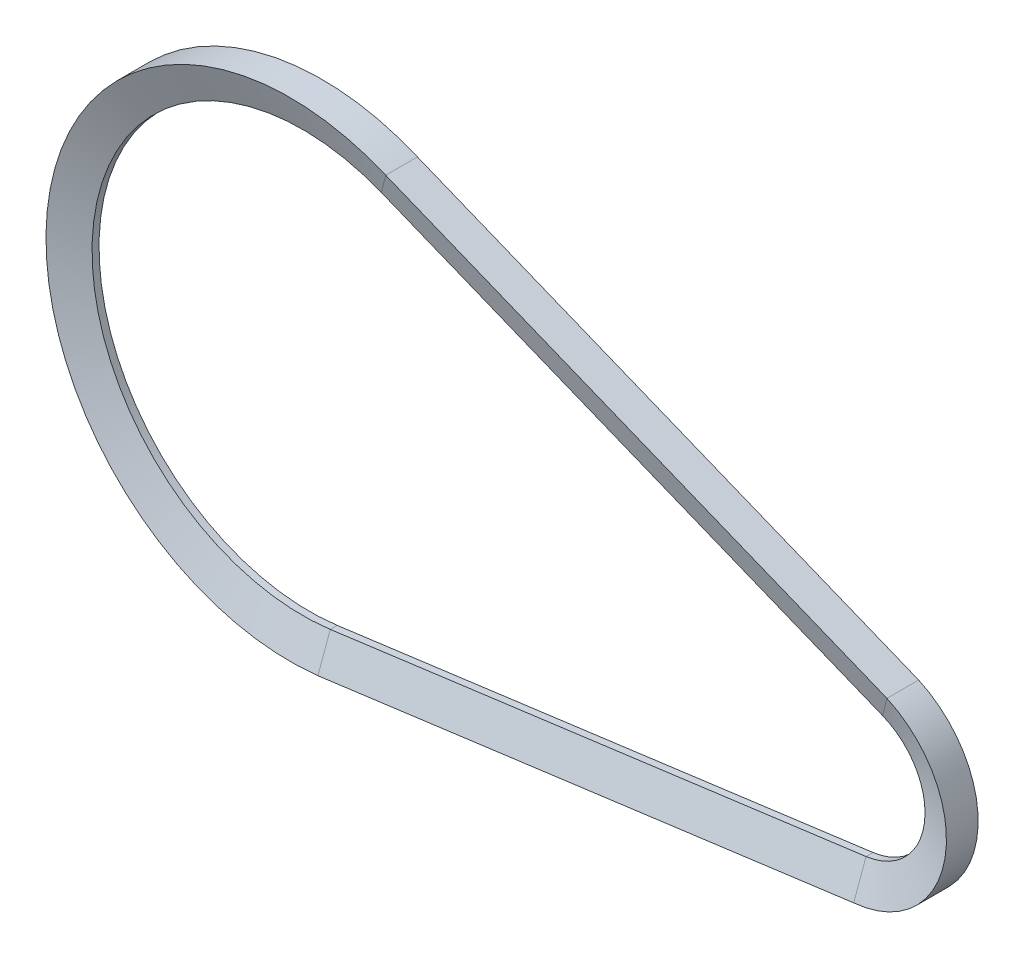
ISO-10303-21;
HEADER;
FILE_DESCRIPTION(('STEP AP214'),'2;1');
FILE_NAME('part.step','',(''),(''),'','','');
FILE_SCHEMA(('AUTOMOTIVE_DESIGN { 1 0 10303 214 1 1 1 1 }'));
ENDSEC;
DATA;
#1=APPLICATION_CONTEXT('core data for automotive mechanical design processes');
#2=APPLICATION_PROTOCOL_DEFINITION('international standard','automotive_design',2000,#1);
#3=PRODUCT_CONTEXT('',#1,'mechanical');
#4=PRODUCT('Part','Part','',(#3));
#5=PRODUCT_RELATED_PRODUCT_CATEGORY('part','',(#4));
#6=PRODUCT_DEFINITION_FORMATION('','',#4);
#7=PRODUCT_DEFINITION_CONTEXT('part definition',#1,'design');
#8=PRODUCT_DEFINITION('design','',#6,#7);
#9=PRODUCT_DEFINITION_SHAPE('','',#8);
#10=(LENGTH_UNIT() NAMED_UNIT(*) SI_UNIT(.MILLI.,.METRE.));
#11=(NAMED_UNIT(*) PLANE_ANGLE_UNIT() SI_UNIT($,.RADIAN.));
#12=(NAMED_UNIT(*) SI_UNIT($,.STERADIAN.) SOLID_ANGLE_UNIT());
#13=UNCERTAINTY_MEASURE_WITH_UNIT(LENGTH_MEASURE(1.E-05),#10,'distance_accuracy_value','');
#14=(GEOMETRIC_REPRESENTATION_CONTEXT(3) GLOBAL_UNCERTAINTY_ASSIGNED_CONTEXT((#13)) GLOBAL_UNIT_ASSIGNED_CONTEXT((#10,
#11,#12)) REPRESENTATION_CONTEXT('',''));
#15=CARTESIAN_POINT('',(0.,0.,0.));
#16=DIRECTION('',(0.,0.,1.));
#17=DIRECTION('',(1.,0.,0.));
#18=AXIS2_PLACEMENT_3D('',#15,#16,#17);
#19=CARTESIAN_POINT('',(124.475719306739,-30.3693151564213,0.770223243003508));
#20=DIRECTION('',(0.0453981297575215,-0.341667511459933,-0.93872377269743));
#21=DIRECTION('',(0.,0.93969262078591,-0.342020143325666));
#22=AXIS2_PLACEMENT_3D('',#19,#20,#21);
#23=PLANE('',#22);
#24=DIRECTION('',(0.,-0.939692620785909,0.342020143325666));
#25=VECTOR('',#24,1.);
#26=CARTESIAN_POINT('',(124.475719306739,-30.3693151564213,0.770223243003508));
#27=LINE('',#26,#25);
#28=CARTESIAN_POINT('',(124.475719306739,-30.3693151564213,0.770223243003508));
#29=VERTEX_POINT('',#28);
#30=CARTESIAN_POINT('',(124.475719306739,-37.8693151564213,3.5));
#31=VERTEX_POINT('',#30);
#32=EDGE_CURVE('E155',#29,#31,#27,.T.);
#33=ORIENTED_EDGE('',*,*,#32,.F.);
#34=DIRECTION('',(-0.991287677094754,-0.131714620449235,0.));
#35=VECTOR('',#34,1.);
#36=CARTESIAN_POINT('',(124.475719306739,-30.3693151564213,0.770223243003508));
#37=LINE('',#36,#35);
#38=CARTESIAN_POINT('',(6.12472985088943,-46.0948769849061,0.770223243003508));
#39=VERTEX_POINT('',#38);
#40=EDGE_CURVE('E154',#29,#39,#37,.T.);
#41=ORIENTED_EDGE('',*,*,#40,.T.);
#42=DIRECTION('',(0.,-0.939692620785909,0.342020143325666));
#43=VECTOR('',#42,1.);
#44=CARTESIAN_POINT('',(6.12472985088943,-46.0948769849061,0.770223243003508));
#45=LINE('',#44,#43);
#46=CARTESIAN_POINT('',(6.12472985088943,-53.5948769849061,3.5));
#47=VERTEX_POINT('',#46);
#48=EDGE_CURVE('E133',#39,#47,#45,.T.);
#49=ORIENTED_EDGE('',*,*,#48,.T.);
#50=DIRECTION('',(-0.991287677094754,-0.131714620449235,0.));
#51=VECTOR('',#50,1.);
#52=CARTESIAN_POINT('',(124.475719306739,-37.8693151564214,3.5));
#53=LINE('',#52,#51);
#54=EDGE_CURVE('E159',#31,#47,#53,.T.);
#55=ORIENTED_EDGE('',*,*,#54,.F.);
#56=EDGE_LOOP('',(#33,#41,#49,#55));
#57=FACE_BOUND('',#56,.T.);
#58=ADVANCED_FACE('F39',(#57),#23,.F.);
#59=CARTESIAN_POINT('',(6.12472985088943,-46.0948769849061,0.770223243003508));
#60=CARTESIAN_POINT('',(-26.763809279918,-50.4648510588701,0.770223243003508));
#61=CARTESIAN_POINT('',(-50.2969528979131,-27.0780207687135,0.770223243003508));
#62=CARTESIAN_POINT('',(-46.1321783681313,5.8371327731105,0.770223243003508));
#63=CARTESIAN_POINT('',(-41.9674038383495,38.7522863149345,0.770223243003508));
#64=CARTESIAN_POINT('',(-13.3508763277611,55.5405867888214,0.770223243003508));
#65=CARTESIAN_POINT('',(17.412721367423,43.1166688715686,0.770223243003508));
#66=CARTESIAN_POINT('',(6.12472985088943,-53.5948769849061,3.5));
#67=CARTESIAN_POINT('',(-32.1150339629088,-57.9648510588701,3.5));
#68=CARTESIAN_POINT('',(-58.9139401287493,-30.3388698408812,3.5));
#69=CARTESIAN_POINT('',(-53.3840209820254,7.75044892662746,3.5));
#70=CARTESIAN_POINT('',(-47.8541018353016,45.8397676941362,3.5));
#71=CARTESIAN_POINT('',(-14.3055621138431,64.7043295098772,3.5));
#72=CARTESIAN_POINT('',(21.1127393983367,49.6404612173529,3.5));
#73=(BOUNDED_SURFACE() B_SPLINE_SURFACE(1,3,((#59,#60,#61,#62,#63,#64,#65),(#66,#67,#68,#69,#70,
#71,#72)),.UNSPECIFIED.,.F.,.F.,.F.) B_SPLINE_SURFACE_WITH_KNOTS((2,2),(4,3,4),(0.,1.),(0.,0.5,
1.),.UNSPECIFIED.) GEOMETRIC_REPRESENTATION_ITEM() RATIONAL_B_SPLINE_SURFACE(((1.,
0.740188803038642,0.740188803038642,1.,0.740188803038642,0.740188803038642,1.),(1.,
0.740188803038642,0.740188803038642,1.,0.740188803038642,0.740188803038642,1.))) REPRESENTATION_ITEM('') SURFACE());
#74=CARTESIAN_POINT('',(0.,0.,3.5));
#75=DIRECTION('',(0.,0.,-1.));
#76=DIRECTION('',(0.113539290883504,-0.993533506946631,0.));
#77=AXIS2_PLACEMENT_3D('',#74,#75,#76);
#78=CIRCLE('',#77,53.94370356931);
#79=CARTESIAN_POINT('',(21.1127393983366,49.6404612173529,3.5));
#80=VERTEX_POINT('',#79);
#81=EDGE_CURVE('E123',#47,#80,#78,.T.);
#82=CARTESIAN_POINT('',(0.,0.,0.770223243003508));
#83=DIRECTION('',(0.,0.,-1.));
#84=DIRECTION('',(0.131714620449235,-0.991287677094754,0.));
#85=AXIS2_PLACEMENT_3D('',#82,#83,#84);
#86=CIRCLE('',#85,46.5);
#87=CARTESIAN_POINT('',(17.4127213674229,43.1166688715686,0.770223243003508));
#88=VERTEX_POINT('',#87);
#89=EDGE_CURVE('E136',#39,#88,#86,.T.);
#90=DIRECTION('',(0.463583952056587,0.817381270249745,0.342020143325666));
#91=VECTOR('',#90,1.);
#92=CARTESIAN_POINT('',(17.4127213674229,43.1166688715686,0.770223243003508));
#93=LINE('',#92,#91);
#94=EDGE_CURVE('E151',#88,#80,#93,.T.);
#95=ORIENTED_EDGE('',*,*,#81,.F.);
#96=ORIENTED_EDGE('',*,*,#48,.F.);
#97=ORIENTED_EDGE('',*,*,#89,.T.);
#98=ORIENTED_EDGE('',*,*,#94,.T.);
#99=EDGE_LOOP('',(#95,#96,#97,#98));
#100=FACE_BOUND('',#99,.T.);
#101=ADVANCED_FACE('F135',(#100),#73,.F.);
#102=CARTESIAN_POINT('',(0.,0.,0.));
#103=DIRECTION('',(0.,0.,-1.));
#104=DIRECTION('',(-1.,0.,0.));
#105=AXIS2_PLACEMENT_3D('',#102,#103,#104);
#106=CYLINDRICAL_SURFACE('',#105,53.94370356931);
#107=CARTESIAN_POINT('',(0.,0.,-3.5));
#108=DIRECTION('',(0.,0.,-1.));
#109=DIRECTION('',(0.113539290883504,-0.993533506946631,0.));
#110=AXIS2_PLACEMENT_3D('',#107,#108,#109);
#111=CIRCLE('',#110,53.94370356931);
#112=CARTESIAN_POINT('',(6.12472985088943,-53.5948769849061,-3.5));
#113=VERTEX_POINT('',#112);
#114=CARTESIAN_POINT('',(21.1127393983366,49.6404612173529,-3.5));
#115=VERTEX_POINT('',#114);
#116=EDGE_CURVE('E117',#113,#115,#111,.T.);
#117=ORIENTED_EDGE('',*,*,#116,.F.);
#118=DIRECTION('',(0.,0.,-1.));
#119=VECTOR('',#118,1.);
#120=CARTESIAN_POINT('',(6.12472985088943,-53.5948769849061,3.5));
#121=LINE('',#120,#119);
#122=EDGE_CURVE('E141',#47,#113,#121,.T.);
#123=ORIENTED_EDGE('',*,*,#122,.F.);
#124=ORIENTED_EDGE('',*,*,#81,.T.);
#125=DIRECTION('',(0.,0.,-1.));
#126=VECTOR('',#125,1.);
#127=CARTESIAN_POINT('',(21.1127393983366,49.6404612173529,3.5));
#128=LINE('',#127,#126);
#129=EDGE_CURVE('E192',#80,#115,#128,.T.);
#130=ORIENTED_EDGE('',*,*,#129,.T.);
#131=EDGE_LOOP('',(#117,#123,#124,#130));
#132=FACE_BOUND('',#131,.T.);
#133=ADVANCED_FACE('F218',(#132),#106,.T.);
#134=CARTESIAN_POINT('',(6.12472985088943,-53.5948769849061,-3.5));
#135=CARTESIAN_POINT('',(-32.1150339629088,-57.9648510588701,-3.5));
#136=CARTESIAN_POINT('',(-58.9139401287493,-30.3388698408812,-3.5));
#137=CARTESIAN_POINT('',(-53.3840209820254,7.75044892662746,-3.5));
#138=CARTESIAN_POINT('',(-47.8541018353016,45.8397676941362,-3.5));
#139=CARTESIAN_POINT('',(-14.3055621138431,64.7043295098772,-3.5));
#140=CARTESIAN_POINT('',(21.1127393983367,49.6404612173529,-3.5));
#141=CARTESIAN_POINT('',(6.12472985088943,-46.0948769849061,-0.770223243003508));
#142=CARTESIAN_POINT('',(-26.763809279918,-50.4648510588701,-0.770223243003508));
#143=CARTESIAN_POINT('',(-50.2969528979131,-27.0780207687135,-0.770223243003508));
#144=CARTESIAN_POINT('',(-46.1321783681313,5.8371327731105,-0.770223243003508));
#145=CARTESIAN_POINT('',(-41.9674038383495,38.7522863149345,-0.770223243003508));
#146=CARTESIAN_POINT('',(-13.3508763277611,55.5405867888214,-0.770223243003508));
#147=CARTESIAN_POINT('',(17.412721367423,43.1166688715686,-0.770223243003508));
#148=(BOUNDED_SURFACE() B_SPLINE_SURFACE(1,3,((#134,#135,#136,#137,#138,#139,#140),(#141,#142,
#143,#144,#145,#146,#147)),.UNSPECIFIED.,.F.,.F.,.F.) B_SPLINE_SURFACE_WITH_KNOTS((2,2),(4,3,4),
(0.,1.),(0.,0.5,1.),
.UNSPECIFIED.) GEOMETRIC_REPRESENTATION_ITEM() RATIONAL_B_SPLINE_SURFACE(((1.,0.740188803038642,
0.740188803038642,1.,0.740188803038642,0.740188803038642,1.),(1.,0.740188803038642,
0.740188803038642,1.,0.740188803038642,0.740188803038642,1.))) REPRESENTATION_ITEM('') SURFACE());
#149=CARTESIAN_POINT('',(0.,0.,-0.770223243003508));
#150=DIRECTION('',(0.,0.,-1.));
#151=DIRECTION('',(0.131714620449235,-0.991287677094754,0.));
#152=AXIS2_PLACEMENT_3D('',#149,#150,#151);
#153=CIRCLE('',#152,46.5);
#154=CARTESIAN_POINT('',(6.12472985088943,-46.0948769849061,-0.770223243003508));
#155=VERTEX_POINT('',#154);
#156=CARTESIAN_POINT('',(17.4127213674229,43.1166688715686,-0.770223243003508));
#157=VERTEX_POINT('',#156);
#158=EDGE_CURVE('E169',#155,#157,#153,.T.);
#159=DIRECTION('',(0.,0.939692620785909,0.342020143325666));
#160=VECTOR('',#159,1.);
#161=CARTESIAN_POINT('',(6.12472985088943,-53.5948769849061,-3.5));
#162=LINE('',#161,#160);
#163=EDGE_CURVE('E162',#113,#155,#162,.T.);
#164=DIRECTION('',(-0.463583952056587,-0.817381270249745,0.342020143325666));
#165=VECTOR('',#164,1.);
#166=CARTESIAN_POINT('',(21.1127393983366,49.6404612173529,-3.5));
#167=LINE('',#166,#165);
#168=EDGE_CURVE('E191',#115,#157,#167,.T.);
#169=ORIENTED_EDGE('',*,*,#158,.F.);
#170=ORIENTED_EDGE('',*,*,#163,.F.);
#171=ORIENTED_EDGE('',*,*,#116,.T.);
#172=ORIENTED_EDGE('',*,*,#168,.T.);
#173=EDGE_LOOP('',(#169,#170,#171,#172));
#174=FACE_BOUND('',#173,.T.);
#175=ADVANCED_FACE('F190',(#174),#148,.F.);
#176=CARTESIAN_POINT('',(0.,0.,0.));
#177=DIRECTION('',(0.,0.,-1.));
#178=DIRECTION('',(-1.,0.,0.));
#179=AXIS2_PLACEMENT_3D('',#176,#177,#178);
#180=CYLINDRICAL_SURFACE('',#179,46.5);
#181=DIRECTION('',(0.,0.,1.));
#182=VECTOR('',#181,1.);
#183=CARTESIAN_POINT('',(17.4127213674229,43.1166688715686,0.770223243003508));
#184=LINE('',#183,#182);
#185=EDGE_CURVE('E149',#157,#88,#184,.T.);
#186=ORIENTED_EDGE('',*,*,#185,.T.);
#187=ORIENTED_EDGE('',*,*,#89,.F.);
#188=DIRECTION('',(0.,0.,1.));
#189=VECTOR('',#188,1.);
#190=CARTESIAN_POINT('',(6.12472985088943,-46.0948769849061,0.770223243003508));
#191=LINE('',#190,#189);
#192=EDGE_CURVE('E148',#155,#39,#191,.T.);
#193=ORIENTED_EDGE('',*,*,#192,.F.);
#194=ORIENTED_EDGE('',*,*,#158,.T.);
#195=EDGE_LOOP('',(#186,#187,#193,#194));
#196=FACE_BOUND('',#195,.T.);
#197=ADVANCED_FACE('F146',(#196),#180,.F.);
#198=CARTESIAN_POINT('',(17.412721367423,43.1166688715686,0.770223243003508));
#199=DIRECTION('',(0.129067730873883,0.319592239298409,-0.93872377269743));
#200=DIRECTION('',(0.,0.946641691748174,0.322287926308379));
#201=AXIS2_PLACEMENT_3D('',#198,#199,#200);
#202=PLANE('',#201);
#203=DIRECTION('',(0.927240190786421,-0.374467126181139,0.));
#204=VECTOR('',#203,1.);
#205=CARTESIAN_POINT('',(21.1127393983367,49.6404612173529,3.5));
#206=LINE('',#205,#204);
#207=CARTESIAN_POINT('',(131.817024923631,4.93239520758056,3.5));
#208=VERTEX_POINT('',#207);
#209=EDGE_CURVE('E104',#80,#208,#206,.T.);
#210=ORIENTED_EDGE('',*,*,#209,.F.);
#211=ORIENTED_EDGE('',*,*,#94,.F.);
#212=DIRECTION('',(0.927240190786421,-0.374467126181139,0.));
#213=VECTOR('',#212,1.);
#214=CARTESIAN_POINT('',(17.412721367423,43.1166688715686,0.770223243003508));
#215=LINE('',#214,#213);
#216=CARTESIAN_POINT('',(128.117006892717,-1.59139713820371,0.770223243003508));
#217=VERTEX_POINT('',#216);
#218=EDGE_CURVE('E168',#88,#217,#215,.T.);
#219=ORIENTED_EDGE('',*,*,#218,.T.);
#220=DIRECTION('',(0.463583952056588,0.817381270249744,0.342020143325666));
#221=VECTOR('',#220,1.);
#222=CARTESIAN_POINT('',(128.117006892717,-1.5913971382037,0.770223243003508));
#223=LINE('',#222,#221);
#224=EDGE_CURVE('E177',#217,#208,#223,.T.);
#225=ORIENTED_EDGE('',*,*,#224,.T.);
#226=EDGE_LOOP('',(#210,#211,#219,#225));
#227=FACE_BOUND('',#226,.T.);
#228=ADVANCED_FACE('F214',(#227),#202,.F.);
#229=CARTESIAN_POINT('',(21.1127393983367,49.6404612173529,3.5));
#230=DIRECTION('',(-0.374467126181139,-0.927240190786421,0.));
#231=DIRECTION('',(0.927240190786421,-0.374467126181139,0.));
#232=AXIS2_PLACEMENT_3D('',#229,#230,#231);
#233=PLANE('',#232);
#234=DIRECTION('',(0.927240190786421,-0.374467126181139,0.));
#235=VECTOR('',#234,1.);
#236=CARTESIAN_POINT('',(21.1127393983367,49.6404612173529,-3.5));
#237=LINE('',#236,#235);
#238=CARTESIAN_POINT('',(131.817024923631,4.93239520758056,-3.5));
#239=VERTEX_POINT('',#238);
#240=EDGE_CURVE('E97',#115,#239,#237,.T.);
#241=ORIENTED_EDGE('',*,*,#240,.F.);
#242=ORIENTED_EDGE('',*,*,#129,.F.);
#243=ORIENTED_EDGE('',*,*,#209,.T.);
#244=DIRECTION('',(0.,0.,-1.));
#245=VECTOR('',#244,1.);
#246=CARTESIAN_POINT('',(131.817024923631,4.93239520758058,3.5));
#247=LINE('',#246,#245);
#248=EDGE_CURVE('E175',#208,#239,#247,.T.);
#249=ORIENTED_EDGE('',*,*,#248,.T.);
#250=EDGE_LOOP('',(#241,#242,#243,#249));
#251=FACE_BOUND('',#250,.T.);
#252=ADVANCED_FACE('F217',(#251),#233,.F.);
#253=CARTESIAN_POINT('',(21.1127393983367,49.6404612173529,-3.5));
#254=DIRECTION('',(0.129067730873883,0.319592239298409,0.938723772697429));
#255=DIRECTION('',(0.,-0.946641691748174,0.322287926308379));
#256=AXIS2_PLACEMENT_3D('',#253,#254,#255);
#257=PLANE('',#256);
#258=DIRECTION('',(0.927240190786421,-0.374467126181139,0.));
#259=VECTOR('',#258,1.);
#260=CARTESIAN_POINT('',(17.412721367423,43.1166688715686,-0.770223243003508));
#261=LINE('',#260,#259);
#262=CARTESIAN_POINT('',(128.117006892717,-1.59139713820371,-0.770223243003508));
#263=VERTEX_POINT('',#262);
#264=EDGE_CURVE('E88',#157,#263,#261,.T.);
#265=ORIENTED_EDGE('',*,*,#264,.F.);
#266=ORIENTED_EDGE('',*,*,#168,.F.);
#267=ORIENTED_EDGE('',*,*,#240,.T.);
#268=DIRECTION('',(-0.463583952056588,-0.817381270249744,0.342020143325666));
#269=VECTOR('',#268,1.);
#270=CARTESIAN_POINT('',(131.817024923631,4.93239520758058,-3.5));
#271=LINE('',#270,#269);
#272=EDGE_CURVE('E172',#239,#263,#271,.T.);
#273=ORIENTED_EDGE('',*,*,#272,.T.);
#274=EDGE_LOOP('',(#265,#266,#267,#273));
#275=FACE_BOUND('',#274,.T.);
#276=ADVANCED_FACE('F236',(#275),#257,.F.);
#277=CARTESIAN_POINT('',(17.412721367423,43.1166688715686,0.770223243003508));
#278=DIRECTION('',(0.374467126181139,0.927240190786421,0.));
#279=DIRECTION('',(-0.927240190786421,0.374467126181139,0.));
#280=AXIS2_PLACEMENT_3D('',#277,#278,#279);
#281=PLANE('',#280);
#282=DIRECTION('',(0.,0.,1.));
#283=VECTOR('',#282,1.);
#284=CARTESIAN_POINT('',(128.117006892717,-1.5913971382037,0.770223243003508));
#285=LINE('',#284,#283);
#286=EDGE_CURVE('E170',#263,#217,#285,.T.);
#287=ORIENTED_EDGE('',*,*,#286,.T.);
#288=ORIENTED_EDGE('',*,*,#218,.F.);
#289=ORIENTED_EDGE('',*,*,#185,.F.);
#290=ORIENTED_EDGE('',*,*,#264,.T.);
#291=EDGE_LOOP('',(#287,#288,#289,#290));
#292=FACE_BOUND('',#291,.T.);
#293=ADVANCED_FACE('F228',(#292),#281,.F.);
#294=CARTESIAN_POINT('',(128.117006892717,-1.59139713820367,0.770223243003508));
#295=CARTESIAN_POINT('',(145.926890042233,-8.78394101937953,0.770223243003508));
#296=CARTESIAN_POINT('',(143.51578882922,-27.8394183480289,0.770223243003508));
#297=CARTESIAN_POINT('',(124.475719306739,-30.3693151564213,0.770223243003508));
#298=CARTESIAN_POINT('',(131.817024923631,4.93239520758061,3.5));
#299=CARTESIAN_POINT('',(157.980585327767,-6.99799973142357,3.5));
#300=CARTESIAN_POINT('',(153.119494172499,-35.3394183480289,3.5));
#301=CARTESIAN_POINT('',(124.475719306738,-37.8693151564213,3.5));
#302=(BOUNDED_SURFACE() B_SPLINE_SURFACE(1,3,((#294,#295,#296,#297),(#298,#299,#300,#301)),
.UNSPECIFIED.,.F.,.F.,.F.) B_SPLINE_SURFACE_WITH_KNOTS((2,2),(4,4),(0.,1.),(0.,1.),
.UNSPECIFIED.) GEOMETRIC_REPRESENTATION_ITEM() RATIONAL_B_SPLINE_SURFACE(((1.,0.503405880312619,
0.503405880312619,1.),(1.,0.503405880312619,0.503405880312619,1.))) REPRESENTATION_ITEM('') SURFACE());
#303=CARTESIAN_POINT('',(122.5,-15.5,3.5));
#304=DIRECTION('',(0.,0.,-1.));
#305=DIRECTION('',(0.414894040337447,0.909869735342631,0.));
#306=AXIS2_PLACEMENT_3D('',#303,#304,#305);
#307=CIRCLE('',#306,22.4563961344273);
#308=EDGE_CURVE('E199',#208,#31,#307,.T.);
#309=CARTESIAN_POINT('',(122.5,-15.5,0.770223243003508));
#310=DIRECTION('',(0.,0.,-1.));
#311=DIRECTION('',(0.374467126181138,0.927240190786422,0.));
#312=AXIS2_PLACEMENT_3D('',#309,#310,#311);
#313=CIRCLE('',#312,15.);
#314=EDGE_CURVE('E171',#217,#29,#313,.T.);
#315=ORIENTED_EDGE('',*,*,#308,.F.);
#316=ORIENTED_EDGE('',*,*,#224,.F.);
#317=ORIENTED_EDGE('',*,*,#314,.T.);
#318=ORIENTED_EDGE('',*,*,#32,.T.);
#319=EDGE_LOOP('',(#315,#316,#317,#318));
#320=FACE_BOUND('',#319,.T.);
#321=ADVANCED_FACE('F226',(#320),#302,.F.);
#322=CARTESIAN_POINT('',(122.5,-15.5,0.));
#323=DIRECTION('',(0.,0.,-1.));
#324=DIRECTION('',(-1.,0.,0.));
#325=AXIS2_PLACEMENT_3D('',#322,#323,#324);
#326=CYLINDRICAL_SURFACE('',#325,22.4563961344273);
#327=CARTESIAN_POINT('',(122.5,-15.5,-3.5));
#328=DIRECTION('',(0.,0.,-1.));
#329=DIRECTION('',(0.414894040337447,0.909869735342631,0.));
#330=AXIS2_PLACEMENT_3D('',#327,#328,#329);
#331=CIRCLE('',#330,22.4563961344273);
#332=CARTESIAN_POINT('',(124.475719306739,-37.8693151564213,-3.5));
#333=VERTEX_POINT('',#332);
#334=EDGE_CURVE('E64',#239,#333,#331,.T.);
#335=ORIENTED_EDGE('',*,*,#334,.F.);
#336=ORIENTED_EDGE('',*,*,#248,.F.);
#337=ORIENTED_EDGE('',*,*,#308,.T.);
#338=DIRECTION('',(0.,0.,-1.));
#339=VECTOR('',#338,1.);
#340=CARTESIAN_POINT('',(124.475719306739,-37.8693151564213,3.5));
#341=LINE('',#340,#339);
#342=EDGE_CURVE('E197',#31,#333,#341,.T.);
#343=ORIENTED_EDGE('',*,*,#342,.T.);
#344=EDGE_LOOP('',(#335,#336,#337,#343));
#345=FACE_BOUND('',#344,.T.);
#346=ADVANCED_FACE('F223',(#345),#326,.T.);
#347=CARTESIAN_POINT('',(131.817024923631,4.93239520758061,-3.5));
#348=CARTESIAN_POINT('',(157.980585327767,-6.99799973142357,-3.5));
#349=CARTESIAN_POINT('',(153.119494172499,-35.3394183480289,-3.5));
#350=CARTESIAN_POINT('',(124.475719306738,-37.8693151564213,-3.5));
#351=CARTESIAN_POINT('',(128.117006892717,-1.59139713820367,-0.770223243003508));
#352=CARTESIAN_POINT('',(145.926890042233,-8.78394101937953,-0.770223243003508));
#353=CARTESIAN_POINT('',(143.51578882922,-27.8394183480289,-0.770223243003508));
#354=CARTESIAN_POINT('',(124.475719306739,-30.3693151564213,-0.770223243003508));
#355=(BOUNDED_SURFACE() B_SPLINE_SURFACE(1,3,((#347,#348,#349,#350),(#351,#352,#353,#354)),
.UNSPECIFIED.,.F.,.F.,.F.) B_SPLINE_SURFACE_WITH_KNOTS((2,2),(4,4),(0.,1.),(0.,1.),
.UNSPECIFIED.) GEOMETRIC_REPRESENTATION_ITEM() RATIONAL_B_SPLINE_SURFACE(((1.,0.503405880312619,
0.503405880312619,1.),(1.,0.503405880312619,0.503405880312619,1.))) REPRESENTATION_ITEM('') SURFACE());
#356=CARTESIAN_POINT('',(122.5,-15.5,-0.770223243003508));
#357=DIRECTION('',(0.,0.,-1.));
#358=DIRECTION('',(0.374467126181138,0.927240190786422,0.));
#359=AXIS2_PLACEMENT_3D('',#356,#357,#358);
#360=CIRCLE('',#359,15.);
#361=CARTESIAN_POINT('',(124.475719306739,-30.3693151564213,-0.770223243003508));
#362=VERTEX_POINT('',#361);
#363=EDGE_CURVE('E56',#263,#362,#360,.T.);
#364=DIRECTION('',(0.,0.939692620785909,0.342020143325666));
#365=VECTOR('',#364,1.);
#366=CARTESIAN_POINT('',(124.475719306739,-37.8693151564213,-3.5));
#367=LINE('',#366,#365);
#368=EDGE_CURVE('E183',#333,#362,#367,.T.);
#369=ORIENTED_EDGE('',*,*,#363,.F.);
#370=ORIENTED_EDGE('',*,*,#272,.F.);
#371=ORIENTED_EDGE('',*,*,#334,.T.);
#372=ORIENTED_EDGE('',*,*,#368,.T.);
#373=EDGE_LOOP('',(#369,#370,#371,#372));
#374=FACE_BOUND('',#373,.T.);
#375=ADVANCED_FACE('F234',(#374),#355,.F.);
#376=CARTESIAN_POINT('',(122.5,-15.5,0.));
#377=DIRECTION('',(0.,0.,-1.));
#378=DIRECTION('',(-1.,0.,0.));
#379=AXIS2_PLACEMENT_3D('',#376,#377,#378);
#380=CYLINDRICAL_SURFACE('',#379,15.);
#381=DIRECTION('',(0.,0.,1.));
#382=VECTOR('',#381,1.);
#383=CARTESIAN_POINT('',(124.475719306739,-30.3693151564213,0.770223243003508));
#384=LINE('',#383,#382);
#385=EDGE_CURVE('E43',#362,#29,#384,.T.);
#386=ORIENTED_EDGE('',*,*,#385,.T.);
#387=ORIENTED_EDGE('',*,*,#314,.F.);
#388=ORIENTED_EDGE('',*,*,#286,.F.);
#389=ORIENTED_EDGE('',*,*,#363,.T.);
#390=EDGE_LOOP('',(#386,#387,#388,#389));
#391=FACE_BOUND('',#390,.T.);
#392=ADVANCED_FACE('F184',(#391),#380,.F.);
#393=CARTESIAN_POINT('',(124.475719306739,-37.8693151564214,3.5));
#394=DIRECTION('',(-0.131714620449235,0.991287677094754,0.));
#395=DIRECTION('',(-0.991287677094755,-0.131714620449235,0.));
#396=AXIS2_PLACEMENT_3D('',#393,#394,#395);
#397=PLANE('',#396);
#398=ORIENTED_EDGE('',*,*,#54,.T.);
#399=ORIENTED_EDGE('',*,*,#122,.T.);
#400=DIRECTION('',(-0.991287677094754,-0.131714620449235,0.));
#401=VECTOR('',#400,1.);
#402=CARTESIAN_POINT('',(124.475719306739,-37.8693151564214,-3.5));
#403=LINE('',#402,#401);
#404=EDGE_CURVE('E48',#333,#113,#403,.T.);
#405=ORIENTED_EDGE('',*,*,#404,.F.);
#406=ORIENTED_EDGE('',*,*,#342,.F.);
#407=EDGE_LOOP('',(#398,#399,#405,#406));
#408=FACE_BOUND('',#407,.T.);
#409=ADVANCED_FACE('F220',(#408),#397,.F.);
#410=CARTESIAN_POINT('',(124.475719306739,-37.8693151564214,-3.5));
#411=DIRECTION('',(0.0453981297575216,-0.341667511459934,0.938723772697429));
#412=DIRECTION('',(0.,-0.93969262078591,-0.342020143325666));
#413=AXIS2_PLACEMENT_3D('',#410,#411,#412);
#414=PLANE('',#413);
#415=ORIENTED_EDGE('',*,*,#404,.T.);
#416=ORIENTED_EDGE('',*,*,#163,.T.);
#417=DIRECTION('',(-0.991287677094754,-0.131714620449235,0.));
#418=VECTOR('',#417,1.);
#419=CARTESIAN_POINT('',(124.475719306739,-30.3693151564213,-0.770223243003508));
#420=LINE('',#419,#418);
#421=EDGE_CURVE('E11',#362,#155,#420,.T.);
#422=ORIENTED_EDGE('',*,*,#421,.F.);
#423=ORIENTED_EDGE('',*,*,#368,.F.);
#424=EDGE_LOOP('',(#415,#416,#422,#423));
#425=FACE_BOUND('',#424,.T.);
#426=ADVANCED_FACE('F188',(#425),#414,.F.);
#427=CARTESIAN_POINT('',(124.475719306739,-30.3693151564213,0.770223243003508));
#428=DIRECTION('',(0.131714620449235,-0.991287677094754,0.));
#429=DIRECTION('',(0.991287677094755,0.131714620449235,0.));
#430=AXIS2_PLACEMENT_3D('',#427,#428,#429);
#431=PLANE('',#430);
#432=ORIENTED_EDGE('',*,*,#421,.T.);
#433=ORIENTED_EDGE('',*,*,#192,.T.);
#434=ORIENTED_EDGE('',*,*,#40,.F.);
#435=ORIENTED_EDGE('',*,*,#385,.F.);
#436=EDGE_LOOP('',(#432,#433,#434,#435));
#437=FACE_BOUND('',#436,.T.);
#438=ADVANCED_FACE('F41',(#437),#431,.F.);
#439=CLOSED_SHELL('',(#58,#101,#133,#175,#197,#228,#252,#276,#293,#321,#346,#375,#392,#409,#426,#438));
#440=MANIFOLD_SOLID_BREP('B2',#439);
#441=ADVANCED_BREP_SHAPE_REPRESENTATION('',(#18,#440),#14);
#442=SHAPE_DEFINITION_REPRESENTATION(#9,#441);
ENDSEC;
END-ISO-10303-21;
